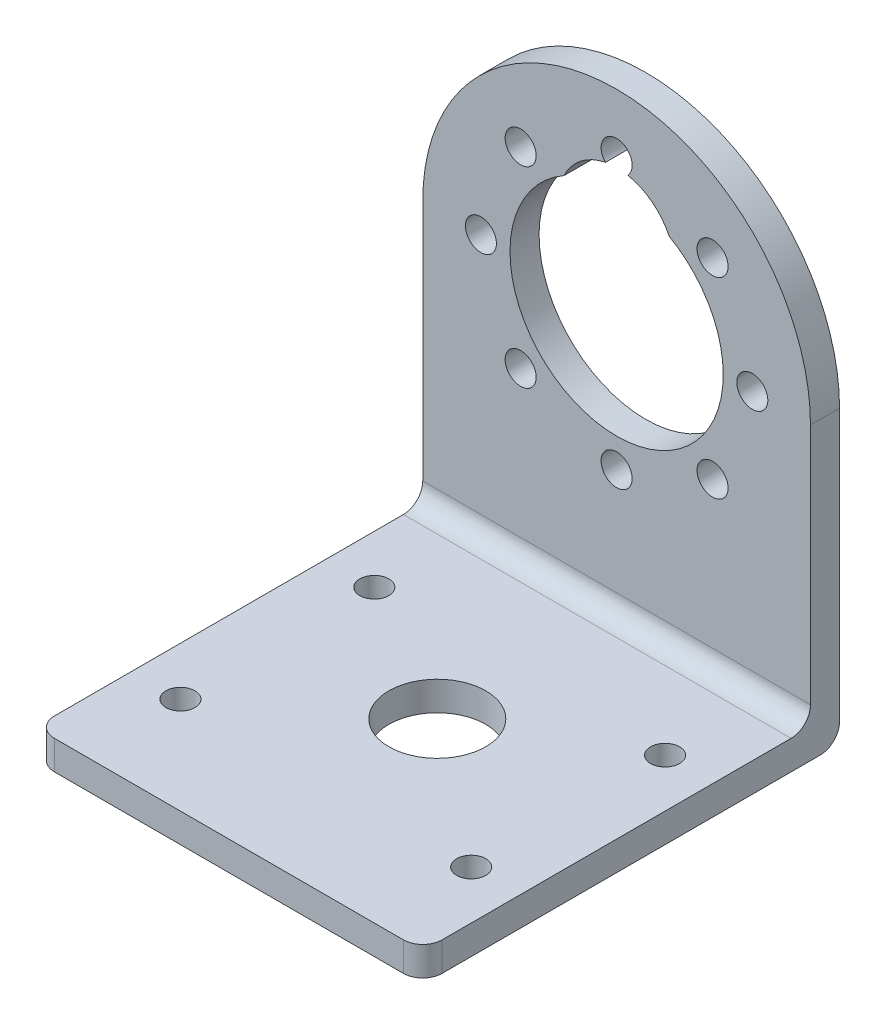
ISO-10303-21;
HEADER;
FILE_DESCRIPTION(('STEP AP214'),'2;1');
FILE_NAME('part.step','',(''),(''),'','','');
FILE_SCHEMA(('AUTOMOTIVE_DESIGN { 1 0 10303 214 1 1 1 1 }'));
ENDSEC;
DATA;
#1=APPLICATION_CONTEXT('core data for automotive mechanical design processes');
#2=APPLICATION_PROTOCOL_DEFINITION('international standard','automotive_design',2000,#1);
#3=PRODUCT_CONTEXT('',#1,'mechanical');
#4=PRODUCT('Part','Part','',(#3));
#5=PRODUCT_RELATED_PRODUCT_CATEGORY('part','',(#4));
#6=PRODUCT_DEFINITION_FORMATION('','',#4);
#7=PRODUCT_DEFINITION_CONTEXT('part definition',#1,'design');
#8=PRODUCT_DEFINITION('design','',#6,#7);
#9=PRODUCT_DEFINITION_SHAPE('','',#8);
#10=(LENGTH_UNIT() NAMED_UNIT(*) SI_UNIT(.MILLI.,.METRE.));
#11=(NAMED_UNIT(*) PLANE_ANGLE_UNIT() SI_UNIT($,.RADIAN.));
#12=(NAMED_UNIT(*) SI_UNIT($,.STERADIAN.) SOLID_ANGLE_UNIT());
#13=UNCERTAINTY_MEASURE_WITH_UNIT(LENGTH_MEASURE(1.E-05),#10,'distance_accuracy_value','');
#14=(GEOMETRIC_REPRESENTATION_CONTEXT(3) GLOBAL_UNCERTAINTY_ASSIGNED_CONTEXT((#13)) GLOBAL_UNIT_ASSIGNED_CONTEXT((#10,
#11,#12)) REPRESENTATION_CONTEXT('',''));
#15=CARTESIAN_POINT('',(0.,0.,0.));
#16=DIRECTION('',(0.,0.,1.));
#17=DIRECTION('',(1.,0.,0.));
#18=AXIS2_PLACEMENT_3D('',#15,#16,#17);
#19=CARTESIAN_POINT('',(0.,3.,0.));
#20=DIRECTION('',(0.,1.,0.));
#21=DIRECTION('',(0.,0.,1.));
#22=AXIS2_PLACEMENT_3D('',#19,#20,#21);
#23=PLANE('',#22);
#24=CARTESIAN_POINT('',(15.,3.,-8.49999999999999));
#25=DIRECTION('',(0.,1.,0.));
#26=DIRECTION('',(0.,0.,1.));
#27=AXIS2_PLACEMENT_3D('',#24,#25,#26);
#28=CIRCLE('',#27,1.5);
#29=CARTESIAN_POINT('',(15.,3.,-7.));
#30=VERTEX_POINT('',#29);
#31=EDGE_CURVE('E205',#30,#30,#28,.T.);
#32=ORIENTED_EDGE('',*,*,#31,.F.);
#33=EDGE_LOOP('',(#32));
#34=FACE_BOUND('',#33,.T.);
#35=CARTESIAN_POINT('',(15.,3.,11.5));
#36=DIRECTION('',(0.,1.,0.));
#37=DIRECTION('',(0.,0.,1.));
#38=AXIS2_PLACEMENT_3D('',#35,#36,#37);
#39=CIRCLE('',#38,1.5);
#40=CARTESIAN_POINT('',(15.,3.,13.));
#41=VERTEX_POINT('',#40);
#42=EDGE_CURVE('E217',#41,#41,#39,.T.);
#43=ORIENTED_EDGE('',*,*,#42,.F.);
#44=EDGE_LOOP('',(#43));
#45=FACE_BOUND('',#44,.T.);
#46=CARTESIAN_POINT('',(-15.,3.,11.5));
#47=DIRECTION('',(0.,1.,0.));
#48=DIRECTION('',(0.,0.,1.));
#49=AXIS2_PLACEMENT_3D('',#46,#47,#48);
#50=CIRCLE('',#49,1.5);
#51=CARTESIAN_POINT('',(-15.,3.,13.));
#52=VERTEX_POINT('',#51);
#53=EDGE_CURVE('E223',#52,#52,#50,.T.);
#54=ORIENTED_EDGE('',*,*,#53,.F.);
#55=EDGE_LOOP('',(#54));
#56=FACE_BOUND('',#55,.T.);
#57=CARTESIAN_POINT('',(-15.,3.,-8.5));
#58=DIRECTION('',(0.,1.,0.));
#59=DIRECTION('',(0.,0.,1.));
#60=AXIS2_PLACEMENT_3D('',#57,#58,#59);
#61=CIRCLE('',#60,1.5);
#62=CARTESIAN_POINT('',(-15.,3.,-7.));
#63=VERTEX_POINT('',#62);
#64=EDGE_CURVE('E211',#63,#63,#61,.T.);
#65=ORIENTED_EDGE('',*,*,#64,.F.);
#66=EDGE_LOOP('',(#65));
#67=FACE_BOUND('',#66,.T.);
#68=CARTESIAN_POINT('',(0.,3.,0.));
#69=DIRECTION('',(0.,1.,0.));
#70=DIRECTION('',(0.,0.,1.));
#71=AXIS2_PLACEMENT_3D('',#68,#69,#70);
#72=CIRCLE('',#71,5.);
#73=CARTESIAN_POINT('',(0.,3.,5.));
#74=VERTEX_POINT('',#73);
#75=EDGE_CURVE('E199',#74,#74,#72,.T.);
#76=ORIENTED_EDGE('',*,*,#75,.F.);
#77=EDGE_LOOP('',(#76));
#78=FACE_BOUND('',#77,.T.);
#79=DIRECTION('',(1.,0.,0.));
#80=VECTOR('',#79,1.);
#81=CARTESIAN_POINT('',(-20.,3.,21.5));
#82=LINE('',#81,#80);
#83=CARTESIAN_POINT('',(-18.,3.,21.5));
#84=VERTEX_POINT('',#83);
#85=CARTESIAN_POINT('',(18.,3.,21.5));
#86=VERTEX_POINT('',#85);
#87=EDGE_CURVE('E236',#84,#86,#82,.T.);
#88=ORIENTED_EDGE('',*,*,#87,.T.);
#89=CARTESIAN_POINT('',(18.,3.,19.5));
#90=DIRECTION('',(0.,1.,0.));
#91=DIRECTION('',(0.,0.,1.));
#92=AXIS2_PLACEMENT_3D('',#89,#90,#91);
#93=CIRCLE('',#92,2.);
#94=CARTESIAN_POINT('',(20.,3.,19.5));
#95=VERTEX_POINT('',#94);
#96=EDGE_CURVE('E273',#86,#95,#93,.T.);
#97=ORIENTED_EDGE('',*,*,#96,.T.);
#98=DIRECTION('',(0.,0.,-1.));
#99=VECTOR('',#98,1.);
#100=CARTESIAN_POINT('',(20.,3.,-21.5));
#101=LINE('',#100,#99);
#102=CARTESIAN_POINT('',(20.,3.,-16.5));
#103=VERTEX_POINT('',#102);
#104=EDGE_CURVE('E229',#95,#103,#101,.T.);
#105=ORIENTED_EDGE('',*,*,#104,.T.);
#106=DIRECTION('',(-1.,0.,0.));
#107=VECTOR('',#106,1.);
#108=CARTESIAN_POINT('',(0.,3.,-16.5));
#109=LINE('',#108,#107);
#110=CARTESIAN_POINT('',(-20.,3.,-16.5));
#111=VERTEX_POINT('',#110);
#112=EDGE_CURVE('E268',#103,#111,#109,.T.);
#113=ORIENTED_EDGE('',*,*,#112,.T.);
#114=DIRECTION('',(0.,0.,1.));
#115=VECTOR('',#114,1.);
#116=CARTESIAN_POINT('',(-20.,3.,-21.5));
#117=LINE('',#116,#115);
#118=CARTESIAN_POINT('',(-20.,3.,19.5));
#119=VERTEX_POINT('',#118);
#120=EDGE_CURVE('E232',#111,#119,#117,.T.);
#121=ORIENTED_EDGE('',*,*,#120,.T.);
#122=CARTESIAN_POINT('',(-18.,3.,19.5));
#123=DIRECTION('',(0.,1.,0.));
#124=DIRECTION('',(0.,0.,1.));
#125=AXIS2_PLACEMENT_3D('',#122,#123,#124);
#126=CIRCLE('',#125,2.);
#127=EDGE_CURVE('E271',#119,#84,#126,.T.);
#128=ORIENTED_EDGE('',*,*,#127,.T.);
#129=EDGE_LOOP('',(#88,#97,#105,#113,#121,#128));
#130=FACE_BOUND('',#129,.T.);
#131=ADVANCED_FACE('F34',(#34,#45,#56,#67,#78,#130),#23,.T.);
#132=CARTESIAN_POINT('',(0.,0.,0.));
#133=DIRECTION('',(0.,1.,0.));
#134=DIRECTION('',(0.,0.,1.));
#135=AXIS2_PLACEMENT_3D('',#132,#133,#134);
#136=PLANE('',#135);
#137=DIRECTION('',(0.,0.,-1.));
#138=VECTOR('',#137,1.);
#139=CARTESIAN_POINT('',(20.,0.,-21.5));
#140=LINE('',#139,#138);
#141=CARTESIAN_POINT('',(20.,0.,19.5));
#142=VERTEX_POINT('',#141);
#143=CARTESIAN_POINT('',(20.,0.,-19.5));
#144=VERTEX_POINT('',#143);
#145=EDGE_CURVE('E226',#142,#144,#140,.T.);
#146=ORIENTED_EDGE('',*,*,#145,.F.);
#147=CARTESIAN_POINT('',(18.,0.,19.5));
#148=DIRECTION('',(0.,1.,0.));
#149=DIRECTION('',(0.,0.,1.));
#150=AXIS2_PLACEMENT_3D('',#147,#148,#149);
#151=CIRCLE('',#150,2.);
#152=CARTESIAN_POINT('',(18.,0.,21.5));
#153=VERTEX_POINT('',#152);
#154=EDGE_CURVE('E261',#142,#153,#151,.F.);
#155=ORIENTED_EDGE('',*,*,#154,.T.);
#156=DIRECTION('',(1.,0.,0.));
#157=VECTOR('',#156,1.);
#158=CARTESIAN_POINT('',(-20.,0.,21.5));
#159=LINE('',#158,#157);
#160=CARTESIAN_POINT('',(-18.,0.,21.5));
#161=VERTEX_POINT('',#160);
#162=EDGE_CURVE('E233',#161,#153,#159,.T.);
#163=ORIENTED_EDGE('',*,*,#162,.F.);
#164=CARTESIAN_POINT('',(-18.,0.,19.5));
#165=DIRECTION('',(0.,1.,0.));
#166=DIRECTION('',(0.,0.,1.));
#167=AXIS2_PLACEMENT_3D('',#164,#165,#166);
#168=CIRCLE('',#167,2.);
#169=CARTESIAN_POINT('',(-20.,0.,19.5));
#170=VERTEX_POINT('',#169);
#171=EDGE_CURVE('E259',#161,#170,#168,.F.);
#172=ORIENTED_EDGE('',*,*,#171,.T.);
#173=DIRECTION('',(0.,0.,1.));
#174=VECTOR('',#173,1.);
#175=CARTESIAN_POINT('',(-20.,0.,-21.5));
#176=LINE('',#175,#174);
#177=CARTESIAN_POINT('',(-20.,0.,-19.5));
#178=VERTEX_POINT('',#177);
#179=EDGE_CURVE('E242',#178,#170,#176,.T.);
#180=ORIENTED_EDGE('',*,*,#179,.F.);
#181=DIRECTION('',(-1.,0.,0.));
#182=VECTOR('',#181,1.);
#183=CARTESIAN_POINT('',(0.,0.,-19.5));
#184=LINE('',#183,#182);
#185=EDGE_CURVE('E257',#178,#144,#184,.F.);
#186=ORIENTED_EDGE('',*,*,#185,.T.);
#187=EDGE_LOOP('',(#146,#155,#163,#172,#180,#186));
#188=FACE_BOUND('',#187,.T.);
#189=CARTESIAN_POINT('',(-15.,0.,11.5));
#190=DIRECTION('',(0.,1.,0.));
#191=DIRECTION('',(0.,0.,1.));
#192=AXIS2_PLACEMENT_3D('',#189,#190,#191);
#193=CIRCLE('',#192,1.5);
#194=CARTESIAN_POINT('',(-15.,0.,13.));
#195=VERTEX_POINT('',#194);
#196=EDGE_CURVE('E220',#195,#195,#193,.T.);
#197=ORIENTED_EDGE('',*,*,#196,.T.);
#198=EDGE_LOOP('',(#197));
#199=FACE_BOUND('',#198,.T.);
#200=CARTESIAN_POINT('',(15.,0.,11.5));
#201=DIRECTION('',(0.,1.,0.));
#202=DIRECTION('',(0.,0.,1.));
#203=AXIS2_PLACEMENT_3D('',#200,#201,#202);
#204=CIRCLE('',#203,1.5);
#205=CARTESIAN_POINT('',(15.,0.,13.));
#206=VERTEX_POINT('',#205);
#207=EDGE_CURVE('E214',#206,#206,#204,.T.);
#208=ORIENTED_EDGE('',*,*,#207,.T.);
#209=EDGE_LOOP('',(#208));
#210=FACE_BOUND('',#209,.T.);
#211=CARTESIAN_POINT('',(-15.,0.,-8.5));
#212=DIRECTION('',(0.,1.,0.));
#213=DIRECTION('',(0.,0.,1.));
#214=AXIS2_PLACEMENT_3D('',#211,#212,#213);
#215=CIRCLE('',#214,1.5);
#216=CARTESIAN_POINT('',(-15.,0.,-7.));
#217=VERTEX_POINT('',#216);
#218=EDGE_CURVE('E208',#217,#217,#215,.T.);
#219=ORIENTED_EDGE('',*,*,#218,.T.);
#220=EDGE_LOOP('',(#219));
#221=FACE_BOUND('',#220,.T.);
#222=CARTESIAN_POINT('',(15.,0.,-8.49999999999999));
#223=DIRECTION('',(0.,1.,0.));
#224=DIRECTION('',(0.,0.,1.));
#225=AXIS2_PLACEMENT_3D('',#222,#223,#224);
#226=CIRCLE('',#225,1.5);
#227=CARTESIAN_POINT('',(15.,0.,-7.));
#228=VERTEX_POINT('',#227);
#229=EDGE_CURVE('E202',#228,#228,#226,.T.);
#230=ORIENTED_EDGE('',*,*,#229,.T.);
#231=EDGE_LOOP('',(#230));
#232=FACE_BOUND('',#231,.T.);
#233=CARTESIAN_POINT('',(0.,0.,0.));
#234=DIRECTION('',(0.,1.,0.));
#235=DIRECTION('',(0.,0.,1.));
#236=AXIS2_PLACEMENT_3D('',#233,#234,#235);
#237=CIRCLE('',#236,5.);
#238=CARTESIAN_POINT('',(0.,0.,5.));
#239=VERTEX_POINT('',#238);
#240=EDGE_CURVE('E196',#239,#239,#237,.T.);
#241=ORIENTED_EDGE('',*,*,#240,.T.);
#242=EDGE_LOOP('',(#241));
#243=FACE_BOUND('',#242,.T.);
#244=ADVANCED_FACE('F310',(#188,#199,#210,#221,#232,#243),#136,.F.);
#245=CARTESIAN_POINT('',(20.,3.,-21.5));
#246=DIRECTION('',(-1.,0.,0.));
#247=DIRECTION('',(0.,0.,1.));
#248=AXIS2_PLACEMENT_3D('',#245,#246,#247);
#249=PLANE('',#248);
#250=ORIENTED_EDGE('',*,*,#104,.F.);
#251=DIRECTION('',(0.,-1.,0.));
#252=VECTOR('',#251,1.);
#253=CARTESIAN_POINT('',(20.,3.,19.5));
#254=LINE('',#253,#252);
#255=EDGE_CURVE('E254',#95,#142,#254,.T.);
#256=ORIENTED_EDGE('',*,*,#255,.T.);
#257=ORIENTED_EDGE('',*,*,#145,.T.);
#258=CARTESIAN_POINT('',(20.,2.,-19.5));
#259=DIRECTION('',(-1.,0.,0.));
#260=DIRECTION('',(0.,0.,1.));
#261=AXIS2_PLACEMENT_3D('',#258,#259,#260);
#262=CIRCLE('',#261,2.);
#263=CARTESIAN_POINT('',(20.,2.,-21.5));
#264=VERTEX_POINT('',#263);
#265=EDGE_CURVE('E252',#144,#264,#262,.F.);
#266=ORIENTED_EDGE('',*,*,#265,.T.);
#267=DIRECTION('',(0.,-1.,0.));
#268=VECTOR('',#267,1.);
#269=CARTESIAN_POINT('',(20.,3.,-21.5));
#270=LINE('',#269,#268);
#271=CARTESIAN_POINT('',(20.,30.,-21.5));
#272=VERTEX_POINT('',#271);
#273=EDGE_CURVE('E249',#272,#264,#270,.T.);
#274=ORIENTED_EDGE('',*,*,#273,.F.);
#275=DIRECTION('',(0.,0.,-1.));
#276=VECTOR('',#275,1.);
#277=CARTESIAN_POINT('',(20.,30.,-18.5));
#278=LINE('',#277,#276);
#279=CARTESIAN_POINT('',(20.,30.,-18.5));
#280=VERTEX_POINT('',#279);
#281=EDGE_CURVE('E193',#280,#272,#278,.T.);
#282=ORIENTED_EDGE('',*,*,#281,.F.);
#283=DIRECTION('',(0.,-1.,0.));
#284=VECTOR('',#283,1.);
#285=CARTESIAN_POINT('',(20.,3.,-18.5));
#286=LINE('',#285,#284);
#287=CARTESIAN_POINT('',(20.,5.,-18.5));
#288=VERTEX_POINT('',#287);
#289=EDGE_CURVE('E182',#280,#288,#286,.T.);
#290=ORIENTED_EDGE('',*,*,#289,.T.);
#291=CARTESIAN_POINT('',(20.,5.,-16.5));
#292=DIRECTION('',(-1.,0.,0.));
#293=DIRECTION('',(0.,0.,1.));
#294=AXIS2_PLACEMENT_3D('',#291,#292,#293);
#295=CIRCLE('',#294,2.);
#296=EDGE_CURVE('E11',#288,#103,#295,.T.);
#297=ORIENTED_EDGE('',*,*,#296,.T.);
#298=EDGE_LOOP('',(#250,#256,#257,#266,#274,#282,#290,#297));
#299=FACE_BOUND('',#298,.T.);
#300=ADVANCED_FACE('F288',(#299),#249,.F.);
#301=CARTESIAN_POINT('',(-20.,3.,-21.5));
#302=DIRECTION('',(0.,0.,1.));
#303=DIRECTION('',(1.,0.,0.));
#304=AXIS2_PLACEMENT_3D('',#301,#302,#303);
#305=PLANE('',#304);
#306=ORIENTED_EDGE('',*,*,#273,.T.);
#307=DIRECTION('',(-1.,0.,0.));
#308=VECTOR('',#307,1.);
#309=CARTESIAN_POINT('',(-20.,2.,-21.5));
#310=LINE('',#309,#308);
#311=CARTESIAN_POINT('',(-20.,2.,-21.5));
#312=VERTEX_POINT('',#311);
#313=EDGE_CURVE('E278',#264,#312,#310,.T.);
#314=ORIENTED_EDGE('',*,*,#313,.T.);
#315=DIRECTION('',(0.,-1.,0.));
#316=VECTOR('',#315,1.);
#317=CARTESIAN_POINT('',(-20.,3.,-21.5));
#318=LINE('',#317,#316);
#319=CARTESIAN_POINT('',(-20.,30.,-21.5));
#320=VERTEX_POINT('',#319);
#321=EDGE_CURVE('E239',#320,#312,#318,.T.);
#322=ORIENTED_EDGE('',*,*,#321,.F.);
#323=CARTESIAN_POINT('',(0.,30.,-21.5));
#324=DIRECTION('',(0.,0.,-1.));
#325=DIRECTION('',(-1.,0.,0.));
#326=AXIS2_PLACEMENT_3D('',#323,#324,#325);
#327=CIRCLE('',#326,20.);
#328=EDGE_CURVE('E178',#320,#272,#327,.T.);
#329=ORIENTED_EDGE('',*,*,#328,.T.);
#330=EDGE_LOOP('',(#306,#314,#322,#329));
#331=FACE_BOUND('',#330,.T.);
#332=CARTESIAN_POINT('',(-9.89949493661155,20.1005050633882,-21.5));
#333=DIRECTION('',(0.,0.,-1.));
#334=DIRECTION('',(-1.,0.,0.));
#335=AXIS2_PLACEMENT_3D('',#332,#333,#334);
#336=CIRCLE('',#335,1.6);
#337=CARTESIAN_POINT('',(-11.4994949366115,20.1005050633882,-21.5));
#338=VERTEX_POINT('',#337);
#339=EDGE_CURVE('E641',#338,#338,#336,.T.);
#340=ORIENTED_EDGE('',*,*,#339,.F.);
#341=EDGE_LOOP('',(#340));
#342=FACE_BOUND('',#341,.T.);
#343=CARTESIAN_POINT('',(-14.,29.9999999999999,-21.5));
#344=DIRECTION('',(0.,0.,-1.));
#345=DIRECTION('',(-1.,0.,0.));
#346=AXIS2_PLACEMENT_3D('',#343,#344,#345);
#347=CIRCLE('',#346,1.6);
#348=CARTESIAN_POINT('',(-15.6,29.9999999999999,-21.5));
#349=VERTEX_POINT('',#348);
#350=EDGE_CURVE('E635',#349,#349,#347,.T.);
#351=ORIENTED_EDGE('',*,*,#350,.F.);
#352=EDGE_LOOP('',(#351));
#353=FACE_BOUND('',#352,.T.);
#354=CARTESIAN_POINT('',(-9.89949493661175,39.8994949366116,-21.5));
#355=DIRECTION('',(0.,0.,-1.));
#356=DIRECTION('',(-1.,0.,0.));
#357=AXIS2_PLACEMENT_3D('',#354,#355,#356);
#358=CIRCLE('',#357,1.6);
#359=CARTESIAN_POINT('',(-11.4994949366118,39.8994949366116,-21.5));
#360=VERTEX_POINT('',#359);
#361=EDGE_CURVE('E629',#360,#360,#358,.T.);
#362=ORIENTED_EDGE('',*,*,#361,.F.);
#363=EDGE_LOOP('',(#362));
#364=FACE_BOUND('',#363,.T.);
#365=CARTESIAN_POINT('',(9.89949493661161,39.8994949366117,-21.5));
#366=DIRECTION('',(0.,0.,-1.));
#367=DIRECTION('',(-1.,0.,0.));
#368=AXIS2_PLACEMENT_3D('',#365,#366,#367);
#369=CIRCLE('',#368,1.60000000000001);
#370=CARTESIAN_POINT('',(8.29949493661161,39.8994949366117,-21.5));
#371=VERTEX_POINT('',#370);
#372=EDGE_CURVE('E623',#371,#371,#369,.T.);
#373=ORIENTED_EDGE('',*,*,#372,.F.);
#374=EDGE_LOOP('',(#373));
#375=FACE_BOUND('',#374,.T.);
#376=CARTESIAN_POINT('',(14.,30.0000000000001,-21.5));
#377=DIRECTION('',(0.,0.,-1.));
#378=DIRECTION('',(-1.,0.,0.));
#379=AXIS2_PLACEMENT_3D('',#376,#377,#378);
#380=CIRCLE('',#379,1.6);
#381=CARTESIAN_POINT('',(12.4,30.0000000000001,-21.5));
#382=VERTEX_POINT('',#381);
#383=EDGE_CURVE('E617',#382,#382,#380,.T.);
#384=ORIENTED_EDGE('',*,*,#383,.F.);
#385=EDGE_LOOP('',(#384));
#386=FACE_BOUND('',#385,.T.);
#387=CARTESIAN_POINT('',(9.89949493661168,20.1005050633883,-21.5));
#388=DIRECTION('',(0.,0.,-1.));
#389=DIRECTION('',(-1.,0.,0.));
#390=AXIS2_PLACEMENT_3D('',#387,#388,#389);
#391=CIRCLE('',#390,1.6);
#392=CARTESIAN_POINT('',(8.29949493661169,20.1005050633883,-21.5));
#393=VERTEX_POINT('',#392);
#394=EDGE_CURVE('E609',#393,#393,#391,.T.);
#395=ORIENTED_EDGE('',*,*,#394,.F.);
#396=EDGE_LOOP('',(#395));
#397=FACE_BOUND('',#396,.T.);
#398=CARTESIAN_POINT('',(0.,16.,-21.5));
#399=DIRECTION('',(0.,0.,-1.));
#400=DIRECTION('',(-1.,0.,0.));
#401=AXIS2_PLACEMENT_3D('',#398,#399,#400);
#402=CIRCLE('',#401,1.6);
#403=CARTESIAN_POINT('',(-1.6,16.,-21.5));
#404=VERTEX_POINT('',#403);
#405=EDGE_CURVE('E165',#404,#404,#402,.T.);
#406=ORIENTED_EDGE('',*,*,#405,.F.);
#407=EDGE_LOOP('',(#406));
#408=FACE_BOUND('',#407,.T.);
#409=CARTESIAN_POINT('',(0.,37.,-21.5));
#410=DIRECTION('',(0.,0.,-1.));
#411=DIRECTION('',(-1.,0.,0.));
#412=AXIS2_PLACEMENT_3D('',#409,#410,#411);
#413=CIRCLE('',#412,6.);
#414=CARTESIAN_POINT('',(1.15096764968092,42.8885714285714,-21.5));
#415=VERTEX_POINT('',#414);
#416=CARTESIAN_POINT('',(5.42104741743138,39.5714285714286,-21.5));
#417=VERTEX_POINT('',#416);
#418=EDGE_CURVE('E141',#415,#417,#413,.T.);
#419=ORIENTED_EDGE('',*,*,#418,.F.);
#420=CARTESIAN_POINT('',(-1.0119048852522E-13,44.,-21.5));
#421=DIRECTION('',(0.,0.,-1.));
#422=DIRECTION('',(-1.,0.,0.));
#423=AXIS2_PLACEMENT_3D('',#420,#421,#422);
#424=CIRCLE('',#423,1.6);
#425=CARTESIAN_POINT('',(-1.15096764968112,42.8885714285714,-21.5));
#426=VERTEX_POINT('',#425);
#427=EDGE_CURVE('E159',#426,#415,#424,.T.);
#428=ORIENTED_EDGE('',*,*,#427,.F.);
#429=CARTESIAN_POINT('',(0.,37.,-21.5));
#430=DIRECTION('',(0.,0.,-1.));
#431=DIRECTION('',(-1.,0.,0.));
#432=AXIS2_PLACEMENT_3D('',#429,#430,#431);
#433=CIRCLE('',#432,6.);
#434=CARTESIAN_POINT('',(-5.42104741743163,39.5714285714285,-21.5));
#435=VERTEX_POINT('',#434);
#436=EDGE_CURVE('E162',#435,#426,#433,.T.);
#437=ORIENTED_EDGE('',*,*,#436,.F.);
#438=CARTESIAN_POINT('',(0.,30.,-21.5));
#439=DIRECTION('',(0.,0.,-1.));
#440=DIRECTION('',(-1.,0.,0.));
#441=AXIS2_PLACEMENT_3D('',#438,#439,#440);
#442=CIRCLE('',#441,11.);
#443=EDGE_CURVE('E171',#417,#435,#442,.T.);
#444=ORIENTED_EDGE('',*,*,#443,.F.);
#445=EDGE_LOOP('',(#419,#428,#437,#444));
#446=FACE_BOUND('',#445,.T.);
#447=ADVANCED_FACE('F314',(#331,#342,#353,#364,#375,#386,#397,#408,#446),#305,.F.);
#448=CARTESIAN_POINT('',(-20.,3.,-21.5));
#449=DIRECTION('',(1.,0.,0.));
#450=DIRECTION('',(0.,0.,-1.));
#451=AXIS2_PLACEMENT_3D('',#448,#449,#450);
#452=PLANE('',#451);
#453=ORIENTED_EDGE('',*,*,#179,.T.);
#454=DIRECTION('',(0.,-1.,0.));
#455=VECTOR('',#454,1.);
#456=CARTESIAN_POINT('',(-20.,3.,19.5));
#457=LINE('',#456,#455);
#458=EDGE_CURVE('E276',#170,#119,#457,.F.);
#459=ORIENTED_EDGE('',*,*,#458,.T.);
#460=ORIENTED_EDGE('',*,*,#120,.F.);
#461=CARTESIAN_POINT('',(-20.,5.,-16.5));
#462=DIRECTION('',(1.,0.,0.));
#463=DIRECTION('',(0.,0.,-1.));
#464=AXIS2_PLACEMENT_3D('',#461,#462,#463);
#465=CIRCLE('',#464,2.);
#466=CARTESIAN_POINT('',(-20.,5.,-18.5));
#467=VERTEX_POINT('',#466);
#468=EDGE_CURVE('E42',#111,#467,#465,.T.);
#469=ORIENTED_EDGE('',*,*,#468,.T.);
#470=DIRECTION('',(0.,1.,0.));
#471=VECTOR('',#470,1.);
#472=CARTESIAN_POINT('',(-20.,3.,-18.5));
#473=LINE('',#472,#471);
#474=CARTESIAN_POINT('',(-20.,30.,-18.5));
#475=VERTEX_POINT('',#474);
#476=EDGE_CURVE('E185',#467,#475,#473,.T.);
#477=ORIENTED_EDGE('',*,*,#476,.T.);
#478=DIRECTION('',(0.,0.,-1.));
#479=VECTOR('',#478,1.);
#480=CARTESIAN_POINT('',(-20.,30.,-18.5));
#481=LINE('',#480,#479);
#482=EDGE_CURVE('E190',#475,#320,#481,.T.);
#483=ORIENTED_EDGE('',*,*,#482,.T.);
#484=ORIENTED_EDGE('',*,*,#321,.T.);
#485=CARTESIAN_POINT('',(-20.,2.,-19.5));
#486=DIRECTION('',(1.,0.,0.));
#487=DIRECTION('',(0.,0.,-1.));
#488=AXIS2_PLACEMENT_3D('',#485,#486,#487);
#489=CIRCLE('',#488,2.);
#490=EDGE_CURVE('E49',#312,#178,#489,.F.);
#491=ORIENTED_EDGE('',*,*,#490,.T.);
#492=EDGE_LOOP('',(#453,#459,#460,#469,#477,#483,#484,#491));
#493=FACE_BOUND('',#492,.T.);
#494=ADVANCED_FACE('F292',(#493),#452,.F.);
#495=CARTESIAN_POINT('',(-20.,3.,21.5));
#496=DIRECTION('',(0.,0.,-1.));
#497=DIRECTION('',(-1.,0.,0.));
#498=AXIS2_PLACEMENT_3D('',#495,#496,#497);
#499=PLANE('',#498);
#500=ORIENTED_EDGE('',*,*,#162,.T.);
#501=DIRECTION('',(0.,-1.,0.));
#502=VECTOR('',#501,1.);
#503=CARTESIAN_POINT('',(18.,3.,21.5));
#504=LINE('',#503,#502);
#505=EDGE_CURVE('E266',#153,#86,#504,.F.);
#506=ORIENTED_EDGE('',*,*,#505,.T.);
#507=ORIENTED_EDGE('',*,*,#87,.F.);
#508=DIRECTION('',(0.,-1.,0.));
#509=VECTOR('',#508,1.);
#510=CARTESIAN_POINT('',(-18.,3.,21.5));
#511=LINE('',#510,#509);
#512=EDGE_CURVE('E263',#84,#161,#511,.T.);
#513=ORIENTED_EDGE('',*,*,#512,.T.);
#514=EDGE_LOOP('',(#500,#506,#507,#513));
#515=FACE_BOUND('',#514,.T.);
#516=ADVANCED_FACE('F301',(#515),#499,.F.);
#517=CARTESIAN_POINT('',(-15.,3.,11.5));
#518=DIRECTION('',(0.,-1.,0.));
#519=DIRECTION('',(0.,0.,-1.));
#520=AXIS2_PLACEMENT_3D('',#517,#518,#519);
#521=CYLINDRICAL_SURFACE('',#520,1.5);
#522=ORIENTED_EDGE('',*,*,#53,.T.);
#523=EDGE_LOOP('',(#522));
#524=FACE_BOUND('',#523,.T.);
#525=ORIENTED_EDGE('',*,*,#196,.F.);
#526=EDGE_LOOP('',(#525));
#527=FACE_BOUND('',#526,.T.);
#528=ADVANCED_FACE('F342',(#524,#527),#521,.F.);
#529=CARTESIAN_POINT('',(15.,3.,11.5));
#530=DIRECTION('',(0.,-1.,0.));
#531=DIRECTION('',(0.,0.,-1.));
#532=AXIS2_PLACEMENT_3D('',#529,#530,#531);
#533=CYLINDRICAL_SURFACE('',#532,1.5);
#534=ORIENTED_EDGE('',*,*,#42,.T.);
#535=EDGE_LOOP('',(#534));
#536=FACE_BOUND('',#535,.T.);
#537=ORIENTED_EDGE('',*,*,#207,.F.);
#538=EDGE_LOOP('',(#537));
#539=FACE_BOUND('',#538,.T.);
#540=ADVANCED_FACE('F558',(#536,#539),#533,.F.);
#541=CARTESIAN_POINT('',(-15.,3.,-8.5));
#542=DIRECTION('',(0.,-1.,0.));
#543=DIRECTION('',(0.,0.,-1.));
#544=AXIS2_PLACEMENT_3D('',#541,#542,#543);
#545=CYLINDRICAL_SURFACE('',#544,1.5);
#546=ORIENTED_EDGE('',*,*,#64,.T.);
#547=EDGE_LOOP('',(#546));
#548=FACE_BOUND('',#547,.T.);
#549=ORIENTED_EDGE('',*,*,#218,.F.);
#550=EDGE_LOOP('',(#549));
#551=FACE_BOUND('',#550,.T.);
#552=ADVANCED_FACE('F548',(#548,#551),#545,.F.);
#553=CARTESIAN_POINT('',(15.,3.,-8.49999999999999));
#554=DIRECTION('',(0.,-1.,0.));
#555=DIRECTION('',(0.,0.,-1.));
#556=AXIS2_PLACEMENT_3D('',#553,#554,#555);
#557=CYLINDRICAL_SURFACE('',#556,1.5);
#558=ORIENTED_EDGE('',*,*,#31,.T.);
#559=EDGE_LOOP('',(#558));
#560=FACE_BOUND('',#559,.T.);
#561=ORIENTED_EDGE('',*,*,#229,.F.);
#562=EDGE_LOOP('',(#561));
#563=FACE_BOUND('',#562,.T.);
#564=ADVANCED_FACE('F329',(#560,#563),#557,.F.);
#565=CARTESIAN_POINT('',(0.,3.,0.));
#566=DIRECTION('',(0.,-1.,0.));
#567=DIRECTION('',(0.,0.,-1.));
#568=AXIS2_PLACEMENT_3D('',#565,#566,#567);
#569=CYLINDRICAL_SURFACE('',#568,5.);
#570=ORIENTED_EDGE('',*,*,#75,.T.);
#571=EDGE_LOOP('',(#570));
#572=FACE_BOUND('',#571,.T.);
#573=ORIENTED_EDGE('',*,*,#240,.F.);
#574=EDGE_LOOP('',(#573));
#575=FACE_BOUND('',#574,.T.);
#576=ADVANCED_FACE('F321',(#572,#575),#569,.F.);
#577=CARTESIAN_POINT('',(0.,30.,-18.5));
#578=DIRECTION('',(0.,0.,-1.));
#579=DIRECTION('',(-1.,0.,0.));
#580=AXIS2_PLACEMENT_3D('',#577,#578,#579);
#581=CYLINDRICAL_SURFACE('',#580,20.);
#582=ORIENTED_EDGE('',*,*,#328,.F.);
#583=ORIENTED_EDGE('',*,*,#482,.F.);
#584=CARTESIAN_POINT('',(0.,30.,-18.5));
#585=DIRECTION('',(0.,0.,-1.));
#586=DIRECTION('',(-1.,0.,0.));
#587=AXIS2_PLACEMENT_3D('',#584,#585,#586);
#588=CIRCLE('',#587,20.);
#589=EDGE_CURVE('E187',#475,#280,#588,.T.);
#590=ORIENTED_EDGE('',*,*,#589,.T.);
#591=ORIENTED_EDGE('',*,*,#281,.T.);
#592=EDGE_LOOP('',(#582,#583,#590,#591));
#593=FACE_BOUND('',#592,.T.);
#594=ADVANCED_FACE('F319',(#593),#581,.T.);
#595=CARTESIAN_POINT('',(0.,30.,-18.5));
#596=DIRECTION('',(0.,0.,-1.));
#597=DIRECTION('',(-1.,0.,0.));
#598=AXIS2_PLACEMENT_3D('',#595,#596,#597);
#599=PLANE('',#598);
#600=CARTESIAN_POINT('',(-9.89949493661155,20.1005050633882,-18.5));
#601=DIRECTION('',(0.,0.,-1.));
#602=DIRECTION('',(-1.,0.,0.));
#603=AXIS2_PLACEMENT_3D('',#600,#601,#602);
#604=CIRCLE('',#603,1.6);
#605=CARTESIAN_POINT('',(-11.4994949366115,20.1005050633882,-18.5));
#606=VERTEX_POINT('',#605);
#607=EDGE_CURVE('E638',#606,#606,#604,.T.);
#608=ORIENTED_EDGE('',*,*,#607,.T.);
#609=EDGE_LOOP('',(#608));
#610=FACE_BOUND('',#609,.T.);
#611=CARTESIAN_POINT('',(-14.,29.9999999999999,-18.5));
#612=DIRECTION('',(0.,0.,-1.));
#613=DIRECTION('',(-1.,0.,0.));
#614=AXIS2_PLACEMENT_3D('',#611,#612,#613);
#615=CIRCLE('',#614,1.6);
#616=CARTESIAN_POINT('',(-15.6,29.9999999999999,-18.5));
#617=VERTEX_POINT('',#616);
#618=EDGE_CURVE('E632',#617,#617,#615,.T.);
#619=ORIENTED_EDGE('',*,*,#618,.T.);
#620=EDGE_LOOP('',(#619));
#621=FACE_BOUND('',#620,.T.);
#622=CARTESIAN_POINT('',(-9.89949493661175,39.8994949366116,-18.5));
#623=DIRECTION('',(0.,0.,-1.));
#624=DIRECTION('',(-1.,0.,0.));
#625=AXIS2_PLACEMENT_3D('',#622,#623,#624);
#626=CIRCLE('',#625,1.6);
#627=CARTESIAN_POINT('',(-11.4994949366118,39.8994949366116,-18.5));
#628=VERTEX_POINT('',#627);
#629=EDGE_CURVE('E626',#628,#628,#626,.T.);
#630=ORIENTED_EDGE('',*,*,#629,.T.);
#631=EDGE_LOOP('',(#630));
#632=FACE_BOUND('',#631,.T.);
#633=CARTESIAN_POINT('',(9.89949493661161,39.8994949366117,-18.5));
#634=DIRECTION('',(0.,0.,-1.));
#635=DIRECTION('',(-1.,0.,0.));
#636=AXIS2_PLACEMENT_3D('',#633,#634,#635);
#637=CIRCLE('',#636,1.60000000000001);
#638=CARTESIAN_POINT('',(8.29949493661161,39.8994949366117,-18.5));
#639=VERTEX_POINT('',#638);
#640=EDGE_CURVE('E620',#639,#639,#637,.T.);
#641=ORIENTED_EDGE('',*,*,#640,.T.);
#642=EDGE_LOOP('',(#641));
#643=FACE_BOUND('',#642,.T.);
#644=CARTESIAN_POINT('',(14.,30.0000000000001,-18.5));
#645=DIRECTION('',(0.,0.,-1.));
#646=DIRECTION('',(-1.,0.,0.));
#647=AXIS2_PLACEMENT_3D('',#644,#645,#646);
#648=CIRCLE('',#647,1.6);
#649=CARTESIAN_POINT('',(12.4,30.0000000000001,-18.5));
#650=VERTEX_POINT('',#649);
#651=EDGE_CURVE('E614',#650,#650,#648,.T.);
#652=ORIENTED_EDGE('',*,*,#651,.T.);
#653=EDGE_LOOP('',(#652));
#654=FACE_BOUND('',#653,.T.);
#655=CARTESIAN_POINT('',(9.89949493661168,20.1005050633883,-18.5));
#656=DIRECTION('',(0.,0.,-1.));
#657=DIRECTION('',(-1.,0.,0.));
#658=AXIS2_PLACEMENT_3D('',#655,#656,#657);
#659=CIRCLE('',#658,1.6);
#660=CARTESIAN_POINT('',(8.29949493661169,20.1005050633883,-18.5));
#661=VERTEX_POINT('',#660);
#662=EDGE_CURVE('E607',#661,#661,#659,.T.);
#663=ORIENTED_EDGE('',*,*,#662,.T.);
#664=EDGE_LOOP('',(#663));
#665=FACE_BOUND('',#664,.T.);
#666=CARTESIAN_POINT('',(0.,16.,-18.5));
#667=DIRECTION('',(0.,0.,-1.));
#668=DIRECTION('',(-1.,0.,0.));
#669=AXIS2_PLACEMENT_3D('',#666,#667,#668);
#670=CIRCLE('',#669,1.6);
#671=CARTESIAN_POINT('',(-1.6,16.,-18.5));
#672=VERTEX_POINT('',#671);
#673=EDGE_CURVE('E172',#672,#672,#670,.T.);
#674=ORIENTED_EDGE('',*,*,#673,.T.);
#675=EDGE_LOOP('',(#674));
#676=FACE_BOUND('',#675,.T.);
#677=CARTESIAN_POINT('',(-1.0119048852522E-13,44.,-18.5));
#678=DIRECTION('',(0.,0.,-1.));
#679=DIRECTION('',(-1.,0.,0.));
#680=AXIS2_PLACEMENT_3D('',#677,#678,#679);
#681=CIRCLE('',#680,1.6);
#682=CARTESIAN_POINT('',(-1.15096764968112,42.8885714285714,-18.5));
#683=VERTEX_POINT('',#682);
#684=CARTESIAN_POINT('',(1.15096764968092,42.8885714285714,-18.5));
#685=VERTEX_POINT('',#684);
#686=EDGE_CURVE('E146',#683,#685,#681,.T.);
#687=ORIENTED_EDGE('',*,*,#686,.T.);
#688=CARTESIAN_POINT('',(0.,37.,-18.5));
#689=DIRECTION('',(0.,0.,-1.));
#690=DIRECTION('',(-1.,0.,0.));
#691=AXIS2_PLACEMENT_3D('',#688,#689,#690);
#692=CIRCLE('',#691,6.);
#693=CARTESIAN_POINT('',(5.42104741743138,39.5714285714286,-18.5));
#694=VERTEX_POINT('',#693);
#695=EDGE_CURVE('E138',#685,#694,#692,.T.);
#696=ORIENTED_EDGE('',*,*,#695,.T.);
#697=CARTESIAN_POINT('',(0.,30.,-18.5));
#698=DIRECTION('',(0.,0.,-1.));
#699=DIRECTION('',(-1.,0.,0.));
#700=AXIS2_PLACEMENT_3D('',#697,#698,#699);
#701=CIRCLE('',#700,11.);
#702=CARTESIAN_POINT('',(-5.42104741743163,39.5714285714285,-18.5));
#703=VERTEX_POINT('',#702);
#704=EDGE_CURVE('E150',#694,#703,#701,.T.);
#705=ORIENTED_EDGE('',*,*,#704,.T.);
#706=CARTESIAN_POINT('',(0.,37.,-18.5));
#707=DIRECTION('',(0.,0.,-1.));
#708=DIRECTION('',(-1.,0.,0.));
#709=AXIS2_PLACEMENT_3D('',#706,#707,#708);
#710=CIRCLE('',#709,6.);
#711=EDGE_CURVE('E154',#703,#683,#710,.T.);
#712=ORIENTED_EDGE('',*,*,#711,.T.);
#713=EDGE_LOOP('',(#687,#696,#705,#712));
#714=FACE_BOUND('',#713,.T.);
#715=ORIENTED_EDGE('',*,*,#476,.F.);
#716=DIRECTION('',(-1.,0.,0.));
#717=VECTOR('',#716,1.);
#718=CARTESIAN_POINT('',(0.,5.,-18.5));
#719=LINE('',#718,#717);
#720=EDGE_CURVE('E280',#467,#288,#719,.F.);
#721=ORIENTED_EDGE('',*,*,#720,.T.);
#722=ORIENTED_EDGE('',*,*,#289,.F.);
#723=ORIENTED_EDGE('',*,*,#589,.F.);
#724=EDGE_LOOP('',(#715,#721,#722,#723));
#725=FACE_BOUND('',#724,.T.);
#726=ADVANCED_FACE('F156',(#610,#621,#632,#643,#654,#665,#676,#714,#725),#599,.F.);
#727=CARTESIAN_POINT('',(0.,37.,-18.5));
#728=DIRECTION('',(0.,0.,-1.));
#729=DIRECTION('',(-1.,0.,0.));
#730=AXIS2_PLACEMENT_3D('',#727,#728,#729);
#731=CYLINDRICAL_SURFACE('',#730,6.);
#732=ORIENTED_EDGE('',*,*,#418,.T.);
#733=DIRECTION('',(0.,0.,-1.));
#734=VECTOR('',#733,1.);
#735=CARTESIAN_POINT('',(5.42104741743138,39.5714285714286,-18.5));
#736=LINE('',#735,#734);
#737=EDGE_CURVE('E134',#694,#417,#736,.T.);
#738=ORIENTED_EDGE('',*,*,#737,.F.);
#739=ORIENTED_EDGE('',*,*,#695,.F.);
#740=DIRECTION('',(0.,0.,-1.));
#741=VECTOR('',#740,1.);
#742=CARTESIAN_POINT('',(1.15096764968092,42.8885714285714,-18.5));
#743=LINE('',#742,#741);
#744=EDGE_CURVE('E176',#685,#415,#743,.T.);
#745=ORIENTED_EDGE('',*,*,#744,.T.);
#746=EDGE_LOOP('',(#732,#738,#739,#745));
#747=FACE_BOUND('',#746,.T.);
#748=ADVANCED_FACE('F136',(#747),#731,.F.);
#749=CARTESIAN_POINT('',(-1.0119048852522E-13,44.,-18.5));
#750=DIRECTION('',(0.,0.,-1.));
#751=DIRECTION('',(-1.,0.,0.));
#752=AXIS2_PLACEMENT_3D('',#749,#750,#751);
#753=CYLINDRICAL_SURFACE('',#752,1.6);
#754=ORIENTED_EDGE('',*,*,#427,.T.);
#755=ORIENTED_EDGE('',*,*,#744,.F.);
#756=ORIENTED_EDGE('',*,*,#686,.F.);
#757=DIRECTION('',(0.,0.,-1.));
#758=VECTOR('',#757,1.);
#759=CARTESIAN_POINT('',(-1.15096764968112,42.8885714285714,-18.5));
#760=LINE('',#759,#758);
#761=EDGE_CURVE('E179',#683,#426,#760,.T.);
#762=ORIENTED_EDGE('',*,*,#761,.T.);
#763=EDGE_LOOP('',(#754,#755,#756,#762));
#764=FACE_BOUND('',#763,.T.);
#765=ADVANCED_FACE('F515',(#764),#753,.F.);
#766=CARTESIAN_POINT('',(0.,37.,-18.5));
#767=DIRECTION('',(0.,0.,-1.));
#768=DIRECTION('',(-1.,0.,0.));
#769=AXIS2_PLACEMENT_3D('',#766,#767,#768);
#770=CYLINDRICAL_SURFACE('',#769,6.);
#771=ORIENTED_EDGE('',*,*,#436,.T.);
#772=ORIENTED_EDGE('',*,*,#761,.F.);
#773=ORIENTED_EDGE('',*,*,#711,.F.);
#774=DIRECTION('',(0.,0.,-1.));
#775=VECTOR('',#774,1.);
#776=CARTESIAN_POINT('',(-5.42104741743163,39.5714285714285,-18.5));
#777=LINE('',#776,#775);
#778=EDGE_CURVE('E145',#703,#435,#777,.T.);
#779=ORIENTED_EDGE('',*,*,#778,.T.);
#780=EDGE_LOOP('',(#771,#772,#773,#779));
#781=FACE_BOUND('',#780,.T.);
#782=ADVANCED_FACE('F506',(#781),#770,.F.);
#783=CARTESIAN_POINT('',(0.,30.,-18.5));
#784=DIRECTION('',(0.,0.,-1.));
#785=DIRECTION('',(-1.,0.,0.));
#786=AXIS2_PLACEMENT_3D('',#783,#784,#785);
#787=CYLINDRICAL_SURFACE('',#786,11.);
#788=ORIENTED_EDGE('',*,*,#443,.T.);
#789=ORIENTED_EDGE('',*,*,#778,.F.);
#790=ORIENTED_EDGE('',*,*,#704,.F.);
#791=ORIENTED_EDGE('',*,*,#737,.T.);
#792=EDGE_LOOP('',(#788,#789,#790,#791));
#793=FACE_BOUND('',#792,.T.);
#794=ADVANCED_FACE('F151',(#793),#787,.F.);
#795=CARTESIAN_POINT('',(0.,16.,-18.5));
#796=DIRECTION('',(0.,0.,-1.));
#797=DIRECTION('',(-1.,0.,0.));
#798=AXIS2_PLACEMENT_3D('',#795,#796,#797);
#799=CYLINDRICAL_SURFACE('',#798,1.6);
#800=ORIENTED_EDGE('',*,*,#673,.F.);
#801=EDGE_LOOP('',(#800));
#802=FACE_BOUND('',#801,.T.);
#803=ORIENTED_EDGE('',*,*,#405,.T.);
#804=EDGE_LOOP('',(#803));
#805=FACE_BOUND('',#804,.T.);
#806=ADVANCED_FACE('F487',(#802,#805),#799,.F.);
#807=CARTESIAN_POINT('',(9.89949493661168,20.1005050633883,-18.5));
#808=DIRECTION('',(0.,0.,-1.));
#809=DIRECTION('',(-1.,0.,0.));
#810=AXIS2_PLACEMENT_3D('',#807,#808,#809);
#811=CYLINDRICAL_SURFACE('',#810,1.6);
#812=ORIENTED_EDGE('',*,*,#662,.F.);
#813=EDGE_LOOP('',(#812));
#814=FACE_BOUND('',#813,.T.);
#815=ORIENTED_EDGE('',*,*,#394,.T.);
#816=EDGE_LOOP('',(#815));
#817=FACE_BOUND('',#816,.T.);
#818=ADVANCED_FACE('F477',(#814,#817),#811,.F.);
#819=CARTESIAN_POINT('',(14.,30.0000000000001,-18.5));
#820=DIRECTION('',(0.,0.,-1.));
#821=DIRECTION('',(-1.,0.,0.));
#822=AXIS2_PLACEMENT_3D('',#819,#820,#821);
#823=CYLINDRICAL_SURFACE('',#822,1.6);
#824=ORIENTED_EDGE('',*,*,#651,.F.);
#825=EDGE_LOOP('',(#824));
#826=FACE_BOUND('',#825,.T.);
#827=ORIENTED_EDGE('',*,*,#383,.T.);
#828=EDGE_LOOP('',(#827));
#829=FACE_BOUND('',#828,.T.);
#830=ADVANCED_FACE('F467',(#826,#829),#823,.F.);
#831=CARTESIAN_POINT('',(9.89949493661161,39.8994949366117,-18.5));
#832=DIRECTION('',(0.,0.,-1.));
#833=DIRECTION('',(-1.,0.,0.));
#834=AXIS2_PLACEMENT_3D('',#831,#832,#833);
#835=CYLINDRICAL_SURFACE('',#834,1.60000000000001);
#836=ORIENTED_EDGE('',*,*,#640,.F.);
#837=EDGE_LOOP('',(#836));
#838=FACE_BOUND('',#837,.T.);
#839=ORIENTED_EDGE('',*,*,#372,.T.);
#840=EDGE_LOOP('',(#839));
#841=FACE_BOUND('',#840,.T.);
#842=ADVANCED_FACE('F457',(#838,#841),#835,.F.);
#843=CARTESIAN_POINT('',(-9.89949493661175,39.8994949366116,-18.5));
#844=DIRECTION('',(0.,0.,-1.));
#845=DIRECTION('',(-1.,0.,0.));
#846=AXIS2_PLACEMENT_3D('',#843,#844,#845);
#847=CYLINDRICAL_SURFACE('',#846,1.6);
#848=ORIENTED_EDGE('',*,*,#629,.F.);
#849=EDGE_LOOP('',(#848));
#850=FACE_BOUND('',#849,.T.);
#851=ORIENTED_EDGE('',*,*,#361,.T.);
#852=EDGE_LOOP('',(#851));
#853=FACE_BOUND('',#852,.T.);
#854=ADVANCED_FACE('F447',(#850,#853),#847,.F.);
#855=CARTESIAN_POINT('',(-14.,29.9999999999999,-18.5));
#856=DIRECTION('',(0.,0.,-1.));
#857=DIRECTION('',(-1.,0.,0.));
#858=AXIS2_PLACEMENT_3D('',#855,#856,#857);
#859=CYLINDRICAL_SURFACE('',#858,1.6);
#860=ORIENTED_EDGE('',*,*,#618,.F.);
#861=EDGE_LOOP('',(#860));
#862=FACE_BOUND('',#861,.T.);
#863=ORIENTED_EDGE('',*,*,#350,.T.);
#864=EDGE_LOOP('',(#863));
#865=FACE_BOUND('',#864,.T.);
#866=ADVANCED_FACE('F437',(#862,#865),#859,.F.);
#867=CARTESIAN_POINT('',(-9.89949493661155,20.1005050633882,-18.5));
#868=DIRECTION('',(0.,0.,-1.));
#869=DIRECTION('',(-1.,0.,0.));
#870=AXIS2_PLACEMENT_3D('',#867,#868,#869);
#871=CYLINDRICAL_SURFACE('',#870,1.6);
#872=ORIENTED_EDGE('',*,*,#607,.F.);
#873=EDGE_LOOP('',(#872));
#874=FACE_BOUND('',#873,.T.);
#875=ORIENTED_EDGE('',*,*,#339,.T.);
#876=EDGE_LOOP('',(#875));
#877=FACE_BOUND('',#876,.T.);
#878=ADVANCED_FACE('F355',(#874,#877),#871,.F.);
#879=CARTESIAN_POINT('',(18.,3.,19.5));
#880=DIRECTION('',(0.,-1.,0.));
#881=DIRECTION('',(0.,0.,-1.));
#882=AXIS2_PLACEMENT_3D('',#879,#880,#881);
#883=CYLINDRICAL_SURFACE('',#882,2.);
#884=ORIENTED_EDGE('',*,*,#96,.F.);
#885=ORIENTED_EDGE('',*,*,#505,.F.);
#886=ORIENTED_EDGE('',*,*,#154,.F.);
#887=ORIENTED_EDGE('',*,*,#255,.F.);
#888=EDGE_LOOP('',(#884,#885,#886,#887));
#889=FACE_BOUND('',#888,.T.);
#890=ADVANCED_FACE('F305',(#889),#883,.T.);
#891=CARTESIAN_POINT('',(-18.,3.,19.5));
#892=DIRECTION('',(0.,-1.,0.));
#893=DIRECTION('',(0.,0.,-1.));
#894=AXIS2_PLACEMENT_3D('',#891,#892,#893);
#895=CYLINDRICAL_SURFACE('',#894,2.);
#896=ORIENTED_EDGE('',*,*,#127,.F.);
#897=ORIENTED_EDGE('',*,*,#458,.F.);
#898=ORIENTED_EDGE('',*,*,#171,.F.);
#899=ORIENTED_EDGE('',*,*,#512,.F.);
#900=EDGE_LOOP('',(#896,#897,#898,#899));
#901=FACE_BOUND('',#900,.T.);
#902=ADVANCED_FACE('F296',(#901),#895,.T.);
#903=CARTESIAN_POINT('',(-20.,2.,-19.5));
#904=DIRECTION('',(-1.,0.,0.));
#905=DIRECTION('',(0.,0.,1.));
#906=AXIS2_PLACEMENT_3D('',#903,#904,#905);
#907=CYLINDRICAL_SURFACE('',#906,2.);
#908=ORIENTED_EDGE('',*,*,#265,.F.);
#909=ORIENTED_EDGE('',*,*,#185,.F.);
#910=ORIENTED_EDGE('',*,*,#490,.F.);
#911=ORIENTED_EDGE('',*,*,#313,.F.);
#912=EDGE_LOOP('',(#908,#909,#910,#911));
#913=FACE_BOUND('',#912,.T.);
#914=ADVANCED_FACE('F312',(#913),#907,.T.);
#915=CARTESIAN_POINT('',(0.,5.,-16.5));
#916=DIRECTION('',(-1.,0.,0.));
#917=DIRECTION('',(0.,0.,1.));
#918=AXIS2_PLACEMENT_3D('',#915,#916,#917);
#919=CYLINDRICAL_SURFACE('',#918,2.);
#920=ORIENTED_EDGE('',*,*,#296,.F.);
#921=ORIENTED_EDGE('',*,*,#720,.F.);
#922=ORIENTED_EDGE('',*,*,#468,.F.);
#923=ORIENTED_EDGE('',*,*,#112,.F.);
#924=EDGE_LOOP('',(#920,#921,#922,#923));
#925=FACE_BOUND('',#924,.T.);
#926=ADVANCED_FACE('F36',(#925),#919,.F.);
#927=CLOSED_SHELL('',(#131,#244,#300,#447,#494,#516,#528,#540,#552,#564,#576,#594,#726,#748,
#765,#782,#794,#806,#818,#830,#842,#854,#866,#878,#890,#902,#914,#926));
#928=MANIFOLD_SOLID_BREP('B2',#927);
#929=ADVANCED_BREP_SHAPE_REPRESENTATION('',(#18,#928),#14);
#930=SHAPE_DEFINITION_REPRESENTATION(#9,#929);
ENDSEC;
END-ISO-10303-21;
